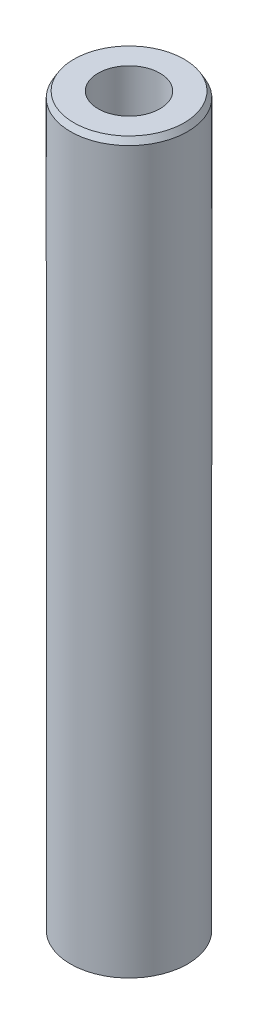
ISO-10303-21;
HEADER;
FILE_DESCRIPTION(('STEP AP214'),'2;1');
FILE_NAME('part.step','',(''),(''),'','','');
FILE_SCHEMA(('AUTOMOTIVE_DESIGN { 1 0 10303 214 1 1 1 1 }'));
ENDSEC;
DATA;
#1=APPLICATION_CONTEXT('core data for automotive mechanical design processes');
#2=APPLICATION_PROTOCOL_DEFINITION('international standard','automotive_design',2000,#1);
#3=PRODUCT_CONTEXT('',#1,'mechanical');
#4=PRODUCT('Part','Part','',(#3));
#5=PRODUCT_RELATED_PRODUCT_CATEGORY('part','',(#4));
#6=PRODUCT_DEFINITION_FORMATION('','',#4);
#7=PRODUCT_DEFINITION_CONTEXT('part definition',#1,'design');
#8=PRODUCT_DEFINITION('design','',#6,#7);
#9=PRODUCT_DEFINITION_SHAPE('','',#8);
#10=(LENGTH_UNIT() NAMED_UNIT(*) SI_UNIT(.MILLI.,.METRE.));
#11=(NAMED_UNIT(*) PLANE_ANGLE_UNIT() SI_UNIT($,.RADIAN.));
#12=(NAMED_UNIT(*) SI_UNIT($,.STERADIAN.) SOLID_ANGLE_UNIT());
#13=UNCERTAINTY_MEASURE_WITH_UNIT(LENGTH_MEASURE(1.E-05),#10,'distance_accuracy_value','');
#14=(GEOMETRIC_REPRESENTATION_CONTEXT(3) GLOBAL_UNCERTAINTY_ASSIGNED_CONTEXT((#13)) GLOBAL_UNIT_ASSIGNED_CONTEXT((#10,
#11,#12)) REPRESENTATION_CONTEXT('',''));
#15=CARTESIAN_POINT('',(0.,0.,0.));
#16=DIRECTION('',(0.,0.,1.));
#17=DIRECTION('',(1.,0.,0.));
#18=AXIS2_PLACEMENT_3D('',#15,#16,#17);
#19=CARTESIAN_POINT('',(0.,187.034323666018,0.));
#20=DIRECTION('',(0.,-1.,0.));
#21=DIRECTION('',(0.,0.,-1.));
#22=AXIS2_PLACEMENT_3D('',#19,#20,#21);
#23=CYLINDRICAL_SURFACE('',#22,15.);
#24=CARTESIAN_POINT('',(0.,185.514735619687,0.));
#25=DIRECTION('',(0.,1.,0.));
#26=DIRECTION('',(0.,0.,1.));
#27=AXIS2_PLACEMENT_3D('',#24,#25,#26);
#28=CIRCLE('',#27,15.);
#29=CARTESIAN_POINT('',(0.,185.514735619687,-15.));
#30=VERTEX_POINT('',#29);
#31=EDGE_CURVE('E50',#30,#30,#28,.F.);
#32=CARTESIAN_POINT('',(0.,0.877334567606525,0.));
#33=DIRECTION('',(0.,1.,0.));
#34=DIRECTION('',(0.,0.,1.));
#35=AXIS2_PLACEMENT_3D('',#32,#33,#34);
#36=CIRCLE('',#35,15.);
#37=CARTESIAN_POINT('',(0.,0.877334567606525,-15.));
#38=VERTEX_POINT('',#37);
#39=EDGE_CURVE('E51',#38,#38,#36,.T.);
#40=CARTESIAN_POINT('',(0.,185.514735619687,-15.));
#41=CARTESIAN_POINT('',(0.,183.591429358728,-15.));
#42=CARTESIAN_POINT('',(0.,181.668123097769,-15.));
#43=CARTESIAN_POINT('',(0.,177.82151057585,-15.));
#44=CARTESIAN_POINT('',(0.,175.898204314891,-15.));
#45=CARTESIAN_POINT('',(0.,172.051591792973,-15.));
#46=CARTESIAN_POINT('',(0.,170.128285532014,-15.));
#47=CARTESIAN_POINT('',(0.,166.281673010095,-15.));
#48=CARTESIAN_POINT('',(0.,164.358366749136,-15.));
#49=CARTESIAN_POINT('',(0.,160.511754227218,-15.));
#50=CARTESIAN_POINT('',(0.,158.588447966259,-15.));
#51=CARTESIAN_POINT('',(0.,154.74183544434,-15.));
#52=CARTESIAN_POINT('',(0.,152.818529183381,-15.));
#53=CARTESIAN_POINT('',(0.,148.971916661463,-15.));
#54=CARTESIAN_POINT('',(0.,147.048610400503,-15.));
#55=CARTESIAN_POINT('',(0.,143.201997878585,-15.));
#56=CARTESIAN_POINT('',(0.,141.278691617626,-15.));
#57=CARTESIAN_POINT('',(0.,137.432079095708,-15.));
#58=CARTESIAN_POINT('',(0.,135.508772834748,-15.));
#59=CARTESIAN_POINT('',(0.,131.66216031283,-15.));
#60=CARTESIAN_POINT('',(0.,129.738854051871,-15.));
#61=CARTESIAN_POINT('',(0.,125.892241529953,-15.));
#62=CARTESIAN_POINT('',(0.,123.968935268993,-15.));
#63=CARTESIAN_POINT('',(0.,120.122322747075,-15.));
#64=CARTESIAN_POINT('',(0.,118.199016486116,-15.));
#65=CARTESIAN_POINT('',(0.,114.352403964198,-15.));
#66=CARTESIAN_POINT('',(0.,112.429097703238,-15.));
#67=CARTESIAN_POINT('',(0.,108.58248518132,-15.));
#68=CARTESIAN_POINT('',(0.,106.659178920361,-15.));
#69=CARTESIAN_POINT('',(0.,102.812566398443,-15.));
#70=CARTESIAN_POINT('',(0.,100.889260137483,-15.));
#71=CARTESIAN_POINT('',(0.,97.0426476155651,-15.));
#72=CARTESIAN_POINT('',(0.,95.1193413546059,-15.));
#73=CARTESIAN_POINT('',(0.,91.2727288326875,-15.));
#74=CARTESIAN_POINT('',(0.,89.3494225717284,-15.));
#75=CARTESIAN_POINT('',(0.,85.50281004981,-15.));
#76=CARTESIAN_POINT('',(0.,83.5795037888509,-15.));
#77=CARTESIAN_POINT('',(0.,79.7328912669325,-15.));
#78=CARTESIAN_POINT('',(0.,77.8095850059733,-15.));
#79=CARTESIAN_POINT('',(0.,73.962972484055,-15.));
#80=CARTESIAN_POINT('',(0.,72.0396662230958,-15.));
#81=CARTESIAN_POINT('',(0.,68.1930537011775,-15.));
#82=CARTESIAN_POINT('',(0.,66.2697474402183,-15.));
#83=CARTESIAN_POINT('',(0.,62.4231349183,-15.));
#84=CARTESIAN_POINT('',(0.,60.4998286573408,-15.));
#85=CARTESIAN_POINT('',(0.,56.6532161354225,-15.));
#86=CARTESIAN_POINT('',(0.,54.7299098744633,-15.));
#87=CARTESIAN_POINT('',(0.,50.883297352545,-15.));
#88=CARTESIAN_POINT('',(0.,48.9599910915858,-15.));
#89=CARTESIAN_POINT('',(0.,45.1133785696674,-15.));
#90=CARTESIAN_POINT('',(0.,43.1900723087083,-15.));
#91=CARTESIAN_POINT('',(0.,39.3434597867899,-15.));
#92=CARTESIAN_POINT('',(0.,37.4201535258307,-15.));
#93=CARTESIAN_POINT('',(0.,33.5735410039124,-15.));
#94=CARTESIAN_POINT('',(0.,31.6502347429533,-15.));
#95=CARTESIAN_POINT('',(0.,27.8036222210349,-15.));
#96=CARTESIAN_POINT('',(0.,25.8803159600757,-15.));
#97=CARTESIAN_POINT('',(0.,22.0337034381574,-15.));
#98=CARTESIAN_POINT('',(0.,20.1103971771982,-15.));
#99=CARTESIAN_POINT('',(0.,16.2637846552799,-15.));
#100=CARTESIAN_POINT('',(0.,14.3404783943207,-15.));
#101=CARTESIAN_POINT('',(0.,10.4938658724024,-15.));
#102=CARTESIAN_POINT('',(0.,8.57055961144321,-15.));
#103=CARTESIAN_POINT('',(0.,4.72394708952488,-15.));
#104=CARTESIAN_POINT('',(0.,2.8006408285657,-15.));
#105=CARTESIAN_POINT('',(0.,0.877334567606525,-15.));
#106=B_SPLINE_CURVE_WITH_KNOTS('',3,(#40,#41,#42,#43,#44,#45,#46,#47,#48,#49,#50,#51,#52,#53,
#54,#55,#56,#57,#58,#59,#60,#61,#62,#63,#64,#65,#66,#67,#68,#69,#70,#71,#72,#73,#74,#75,#76,#77,
#78,#79,#80,#81,#82,#83,#84,#85,#86,#87,#88,#89,#90,#91,#92,#93,#94,#95,#96,#97,#98,#99,#100,
#101,#102,#103,#104,#105),.UNSPECIFIED.,.F.,.F.,(4,2,2,2,2,2,2,2,2,2,2,2,2,2,2,2,2,2,2,2,2,2,2,
2,2,2,2,2,2,2,2,2,4),(0.,5.76991878287753,11.5398375657551,17.3097563486326,23.0796751315101,
28.8495939143876,34.6195126972651,40.3894314801426,46.1593502630201,51.9292690458976,
57.6991878287751,63.4691066116526,69.2390253945302,75.0089441774077,80.7788629602852,
86.5487817431627,92.3187005260402,98.0886193089177,103.858538091795,109.628456874673,
115.39837565755,121.168294440428,126.938213223305,132.708132006183,138.47805078906,
144.247969571938,150.017888354815,155.787807137693,161.55772592057,167.327644703448,
173.097563486325,178.867482269203,184.63740105208),.UNSPECIFIED.);
#107=EDGE_CURVE('BSEAM39',#30,#38,#106,.T.);
#108=ORIENTED_EDGE('',*,*,#31,.T.);
#109=ORIENTED_EDGE('',*,*,#39,.T.);
#110=ORIENTED_EDGE('',*,*,#107,.T.);
#111=ORIENTED_EDGE('',*,*,#107,.F.);
#112=EDGE_LOOP('',(#108,#110,#109,#111));
#113=FACE_BOUND('',#112,.T.);
#114=ADVANCED_FACE('F39',(#113),#23,.T.);
#115=CARTESIAN_POINT('',(0.,187.034323666018,0.));
#116=DIRECTION('',(0.,1.,0.));
#117=DIRECTION('',(0.,0.,1.));
#118=AXIS2_PLACEMENT_3D('',#115,#116,#117);
#119=PLANE('',#118);
#120=CARTESIAN_POINT('',(0.,187.034323666018,0.));
#121=DIRECTION('',(0.,1.,0.));
#122=DIRECTION('',(0.,0.,1.));
#123=AXIS2_PLACEMENT_3D('',#120,#121,#122);
#124=CIRCLE('',#123,14.1226654323936);
#125=CARTESIAN_POINT('',(0.,187.034323666018,-14.1226654323936));
#126=VERTEX_POINT('',#125);
#127=EDGE_CURVE('E54',#126,#126,#124,.T.);
#128=ORIENTED_EDGE('',*,*,#127,.T.);
#129=EDGE_LOOP('',(#128));
#130=FACE_BOUND('',#129,.T.);
#131=CARTESIAN_POINT('',(0.,187.034323666018,0.));
#132=DIRECTION('',(0.,1.,0.));
#133=DIRECTION('',(0.,0.,1.));
#134=AXIS2_PLACEMENT_3D('',#131,#132,#133);
#135=CIRCLE('',#134,7.91619731904316);
#136=CARTESIAN_POINT('',(0.,187.034323666018,-7.91619731904316));
#137=VERTEX_POINT('',#136);
#138=EDGE_CURVE('E58',#137,#137,#135,.T.);
#139=ORIENTED_EDGE('',*,*,#138,.F.);
#140=EDGE_LOOP('',(#139));
#141=FACE_BOUND('',#140,.T.);
#142=ADVANCED_FACE('F69',(#130,#141),#119,.T.);
#143=CARTESIAN_POINT('',(0.,0.,0.));
#144=DIRECTION('',(0.,1.,0.));
#145=DIRECTION('',(0.,0.,1.));
#146=AXIS2_PLACEMENT_3D('',#143,#144,#145);
#147=PLANE('',#146);
#148=CARTESIAN_POINT('',(0.,0.,0.));
#149=DIRECTION('',(0.,1.,0.));
#150=DIRECTION('',(0.,0.,1.));
#151=AXIS2_PLACEMENT_3D('',#148,#149,#150);
#152=CIRCLE('',#151,13.480411953669);
#153=CARTESIAN_POINT('',(0.,0.,13.480411953669));
#154=VERTEX_POINT('',#153);
#155=EDGE_CURVE('E10',#154,#154,#152,.F.);
#156=ORIENTED_EDGE('',*,*,#155,.T.);
#157=EDGE_LOOP('',(#156));
#158=FACE_BOUND('',#157,.T.);
#159=CARTESIAN_POINT('',(0.,0.,0.));
#160=DIRECTION('',(0.,1.,0.));
#161=DIRECTION('',(0.,0.,1.));
#162=AXIS2_PLACEMENT_3D('',#159,#160,#161);
#163=CIRCLE('',#162,7.91619731904316);
#164=CARTESIAN_POINT('',(0.,0.,-7.91619731904316));
#165=VERTEX_POINT('',#164);
#166=EDGE_CURVE('E63',#165,#165,#163,.T.);
#167=ORIENTED_EDGE('',*,*,#166,.T.);
#168=EDGE_LOOP('',(#167));
#169=FACE_BOUND('',#168,.T.);
#170=ADVANCED_FACE('F75',(#158,#169),#147,.F.);
#171=CARTESIAN_POINT('',(0.,187.034323666018,0.));
#172=DIRECTION('',(0.,-1.,0.));
#173=DIRECTION('',(0.,0.,-1.));
#174=AXIS2_PLACEMENT_3D('',#171,#172,#173);
#175=CYLINDRICAL_SURFACE('',#174,7.91619731904316);
#176=CARTESIAN_POINT('',(0.,187.034323666018,-7.91619731904316));
#177=CARTESIAN_POINT('',(0.,185.086049461163,-7.91619731904316));
#178=CARTESIAN_POINT('',(0.,183.137775256309,-7.91619731904316));
#179=CARTESIAN_POINT('',(0.,179.2412268466,-7.91619731904316));
#180=CARTESIAN_POINT('',(0.,177.292952641746,-7.91619731904316));
#181=CARTESIAN_POINT('',(0.,173.396404232037,-7.91619731904316));
#182=CARTESIAN_POINT('',(0.,171.448130027183,-7.91619731904316));
#183=CARTESIAN_POINT('',(0.,167.551581617474,-7.91619731904316));
#184=CARTESIAN_POINT('',(0.,165.60330741262,-7.91619731904316));
#185=CARTESIAN_POINT('',(0.,161.706759002911,-7.91619731904316));
#186=CARTESIAN_POINT('',(0.,159.758484798057,-7.91619731904316));
#187=CARTESIAN_POINT('',(0.,155.861936388348,-7.91619731904316));
#188=CARTESIAN_POINT('',(0.,153.913662183494,-7.91619731904316));
#189=CARTESIAN_POINT('',(0.,150.017113773785,-7.91619731904316));
#190=CARTESIAN_POINT('',(0.,148.068839568931,-7.91619731904316));
#191=CARTESIAN_POINT('',(0.,144.172291159222,-7.91619731904316));
#192=CARTESIAN_POINT('',(0.,142.224016954368,-7.91619731904316));
#193=CARTESIAN_POINT('',(0.,138.327468544659,-7.91619731904316));
#194=CARTESIAN_POINT('',(0.,136.379194339805,-7.91619731904316));
#195=CARTESIAN_POINT('',(0.,132.482645930096,-7.91619731904316));
#196=CARTESIAN_POINT('',(0.,130.534371725241,-7.91619731904316));
#197=CARTESIAN_POINT('',(0.,126.637823315533,-7.91619731904316));
#198=CARTESIAN_POINT('',(0.,124.689549110678,-7.91619731904316));
#199=CARTESIAN_POINT('',(0.,120.79300070097,-7.91619731904316));
#200=CARTESIAN_POINT('',(0.,118.844726496115,-7.91619731904316));
#201=CARTESIAN_POINT('',(0.,114.948178086407,-7.91619731904316));
#202=CARTESIAN_POINT('',(0.,112.999903881552,-7.91619731904316));
#203=CARTESIAN_POINT('',(0.,109.103355471844,-7.91619731904316));
#204=CARTESIAN_POINT('',(0.,107.155081266989,-7.91619731904316));
#205=CARTESIAN_POINT('',(0.,103.258532857281,-7.91619731904316));
#206=CARTESIAN_POINT('',(0.,101.310258652426,-7.91619731904316));
#207=CARTESIAN_POINT('',(0.,97.4137102427175,-7.91619731904316));
#208=CARTESIAN_POINT('',(0.,95.4654360378632,-7.91619731904316));
#209=CARTESIAN_POINT('',(0.,91.5688876281545,-7.91619731904316));
#210=CARTESIAN_POINT('',(0.,89.6206134233001,-7.91619731904316));
#211=CARTESIAN_POINT('',(0.,85.7240650135914,-7.91619731904316));
#212=CARTESIAN_POINT('',(0.,83.7757908087371,-7.91619731904316));
#213=CARTESIAN_POINT('',(0.,79.8792423990284,-7.91619731904316));
#214=CARTESIAN_POINT('',(0.,77.930968194174,-7.91619731904316));
#215=CARTESIAN_POINT('',(0.,74.0344197844653,-7.91619731904316));
#216=CARTESIAN_POINT('',(0.,72.086145579611,-7.91619731904316));
#217=CARTESIAN_POINT('',(0.,68.1895971699023,-7.91619731904316));
#218=CARTESIAN_POINT('',(0.,66.2413229650479,-7.91619731904316));
#219=CARTESIAN_POINT('',(0.,62.3447745553392,-7.91619731904316));
#220=CARTESIAN_POINT('',(0.,60.3965003504849,-7.91619731904316));
#221=CARTESIAN_POINT('',(0.,56.4999519407762,-7.91619731904316));
#222=CARTESIAN_POINT('',(0.,54.5516777359218,-7.91619731904316));
#223=CARTESIAN_POINT('',(0.,50.6551293262131,-7.91619731904316));
#224=CARTESIAN_POINT('',(0.,48.7068551213588,-7.91619731904316));
#225=CARTESIAN_POINT('',(0.,44.8103067116501,-7.91619731904316));
#226=CARTESIAN_POINT('',(0.,42.8620325067957,-7.91619731904316));
#227=CARTESIAN_POINT('',(0.,38.965484097087,-7.91619731904316));
#228=CARTESIAN_POINT('',(0.,37.0172098922327,-7.91619731904316));
#229=CARTESIAN_POINT('',(0.,33.120661482524,-7.91619731904316));
#230=CARTESIAN_POINT('',(0.,31.1723872776696,-7.91619731904316));
#231=CARTESIAN_POINT('',(0.,27.2758388679609,-7.91619731904316));
#232=CARTESIAN_POINT('',(0.,25.3275646631066,-7.91619731904316));
#233=CARTESIAN_POINT('',(0.,21.4310162533979,-7.91619731904316));
#234=CARTESIAN_POINT('',(0.,19.4827420485435,-7.91619731904316));
#235=CARTESIAN_POINT('',(0.,15.5861936388348,-7.91619731904316));
#236=CARTESIAN_POINT('',(0.,13.6379194339805,-7.91619731904316));
#237=CARTESIAN_POINT('',(0.,9.74137102427175,-7.91619731904316));
#238=CARTESIAN_POINT('',(0.,7.79309681941739,-7.91619731904316));
#239=CARTESIAN_POINT('',(0.,3.89654840970869,-7.91619731904316));
#240=CARTESIAN_POINT('',(0.,1.94827420485435,-7.91619731904316));
#241=CARTESIAN_POINT('',(0.,0.,-7.91619731904316));
#242=B_SPLINE_CURVE_WITH_KNOTS('',3,(#176,#177,#178,#179,#180,#181,#182,#183,#184,#185,#186,
#187,#188,#189,#190,#191,#192,#193,#194,#195,#196,#197,#198,#199,#200,#201,#202,#203,#204,#205,
#206,#207,#208,#209,#210,#211,#212,#213,#214,#215,#216,#217,#218,#219,#220,#221,#222,#223,#224,
#225,#226,#227,#228,#229,#230,#231,#232,#233,#234,#235,#236,#237,#238,#239,#240,#241),
.UNSPECIFIED.,.F.,.F.,(4,2,2,2,2,2,2,2,2,2,2,2,2,2,2,2,2,2,2,2,2,2,2,2,2,2,2,2,2,2,2,2,4),(0.,
5.84482261456304,11.6896452291261,17.5344678436891,23.3792904582522,29.2241130728152,
35.0689356873783,40.9137583019413,46.7585809165044,52.6034035310675,58.4482261456305,
64.2930487601935,70.1378713747566,75.9826939893196,81.8275166038827,87.6723392184458,
93.5171618330088,99.3619844475719,105.206807062135,111.051629676698,116.896452291261,
122.741274905824,128.586097520387,134.43092013495,140.275742749513,146.120565364076,
151.965387978639,157.810210593202,163.655033207765,169.499855822328,175.344678436892,
181.189501051455,187.034323666018),.UNSPECIFIED.);
#243=EDGE_CURVE('BSEAM70',#137,#165,#242,.T.);
#244=ORIENTED_EDGE('',*,*,#138,.T.);
#245=ORIENTED_EDGE('',*,*,#166,.F.);
#246=ORIENTED_EDGE('',*,*,#243,.T.);
#247=ORIENTED_EDGE('',*,*,#243,.F.);
#248=EDGE_LOOP('',(#244,#246,#245,#247));
#249=FACE_BOUND('',#248,.T.);
#250=ADVANCED_FACE('F70',(#249),#175,.F.);
#251=CARTESIAN_POINT('',(0.,187.034323666018,0.));
#252=DIRECTION('',(0.,-1.,0.));
#253=DIRECTION('',(0.,0.,-1.));
#254=AXIS2_PLACEMENT_3D('',#251,#252,#253);
#255=CONICAL_SURFACE('',#254,14.1226654323936,0.523598775598293);
#256=CARTESIAN_POINT('',(0.,185.514735619687,-15.));
#257=CARTESIAN_POINT('',(0.,185.530564661836,-14.9908610982541));
#258=CARTESIAN_POINT('',(0.,185.546393703985,-14.9817221965082));
#259=CARTESIAN_POINT('',(0.,185.578051788284,-14.9634443930164));
#260=CARTESIAN_POINT('',(0.,185.593880830433,-14.9543054912705));
#261=CARTESIAN_POINT('',(0.,185.625538914732,-14.9360276877787));
#262=CARTESIAN_POINT('',(0.,185.641367956881,-14.9268887860328));
#263=CARTESIAN_POINT('',(0.,185.67302604118,-14.908610982541));
#264=CARTESIAN_POINT('',(0.,185.688855083329,-14.8994720807951));
#265=CARTESIAN_POINT('',(0.,185.720513167628,-14.8811942773033));
#266=CARTESIAN_POINT('',(0.,185.736342209777,-14.8720553755574));
#267=CARTESIAN_POINT('',(0.,185.768000294075,-14.8537775720656));
#268=CARTESIAN_POINT('',(0.,185.783829336225,-14.8446386703197));
#269=CARTESIAN_POINT('',(0.,185.815487420523,-14.8263608668279));
#270=CARTESIAN_POINT('',(0.,185.831316462672,-14.817221965082));
#271=CARTESIAN_POINT('',(0.,185.862974546971,-14.7989441615902));
#272=CARTESIAN_POINT('',(0.,185.87880358912,-14.7898052598443));
#273=CARTESIAN_POINT('',(0.,185.910461673419,-14.7715274563525));
#274=CARTESIAN_POINT('',(0.,185.926290715568,-14.7623885546066));
#275=CARTESIAN_POINT('',(0.,185.957948799867,-14.7441107511148));
#276=CARTESIAN_POINT('',(0.,185.973777842016,-14.7349718493689));
#277=CARTESIAN_POINT('',(0.,186.005435926315,-14.7166940458771));
#278=CARTESIAN_POINT('',(0.,186.021264968464,-14.7075551441312));
#279=CARTESIAN_POINT('',(0.,186.052923052762,-14.6892773406394));
#280=CARTESIAN_POINT('',(0.,186.068752094912,-14.6801384388935));
#281=CARTESIAN_POINT('',(0.,186.10041017921,-14.6618606354017));
#282=CARTESIAN_POINT('',(0.,186.11623922136,-14.6527217336558));
#283=CARTESIAN_POINT('',(0.,186.147897305658,-14.634443930164));
#284=CARTESIAN_POINT('',(0.,186.163726347807,-14.6253050284181));
#285=CARTESIAN_POINT('',(0.,186.195384432106,-14.6070272249263));
#286=CARTESIAN_POINT('',(0.,186.211213474255,-14.5978883231804));
#287=CARTESIAN_POINT('',(0.,186.242871558554,-14.5796105196886));
#288=CARTESIAN_POINT('',(0.,186.258700600703,-14.5704716179427));
#289=CARTESIAN_POINT('',(0.,186.290358685002,-14.5521938144509));
#290=CARTESIAN_POINT('',(0.,186.306187727151,-14.543054912705));
#291=CARTESIAN_POINT('',(0.,186.337845811449,-14.5247771092132));
#292=CARTESIAN_POINT('',(0.,186.353674853599,-14.5156382074673));
#293=CARTESIAN_POINT('',(0.,186.385332937897,-14.4973604039755));
#294=CARTESIAN_POINT('',(0.,186.401161980047,-14.4882215022296));
#295=CARTESIAN_POINT('',(0.,186.432820064345,-14.4699436987378));
#296=CARTESIAN_POINT('',(0.,186.448649106494,-14.4608047969919));
#297=CARTESIAN_POINT('',(0.,186.480307190793,-14.4425269935001));
#298=CARTESIAN_POINT('',(0.,186.496136232942,-14.4333880917542));
#299=CARTESIAN_POINT('',(0.,186.527794317241,-14.4151102882624));
#300=CARTESIAN_POINT('',(0.,186.54362335939,-14.4059713865165));
#301=CARTESIAN_POINT('',(0.,186.575281443689,-14.3876935830247));
#302=CARTESIAN_POINT('',(0.,186.591110485838,-14.3785546812788));
#303=CARTESIAN_POINT('',(0.,186.622768570136,-14.360276877787));
#304=CARTESIAN_POINT('',(0.,186.638597612286,-14.3511379760411));
#305=CARTESIAN_POINT('',(0.,186.670255696584,-14.3328601725493));
#306=CARTESIAN_POINT('',(0.,186.686084738734,-14.3237212708034));
#307=CARTESIAN_POINT('',(0.,186.717742823032,-14.3054434673116));
#308=CARTESIAN_POINT('',(0.,186.733571865181,-14.2963045655657));
#309=CARTESIAN_POINT('',(0.,186.76522994948,-14.2780267620739));
#310=CARTESIAN_POINT('',(0.,186.781058991629,-14.268887860328));
#311=CARTESIAN_POINT('',(0.,186.812717075928,-14.2506100568362));
#312=CARTESIAN_POINT('',(0.,186.828546118077,-14.2414711550903));
#313=CARTESIAN_POINT('',(0.,186.860204202376,-14.2231933515985));
#314=CARTESIAN_POINT('',(0.,186.876033244525,-14.2140544498526));
#315=CARTESIAN_POINT('',(0.,186.907691328823,-14.1957766463608));
#316=CARTESIAN_POINT('',(0.,186.923520370973,-14.1866377446149));
#317=CARTESIAN_POINT('',(0.,186.955178455271,-14.1683599411231));
#318=CARTESIAN_POINT('',(0.,186.971007497421,-14.1592210393772));
#319=CARTESIAN_POINT('',(0.,187.002665581719,-14.1409432358854));
#320=CARTESIAN_POINT('',(0.,187.018494623868,-14.1318043341395));
#321=CARTESIAN_POINT('',(0.,187.034323666018,-14.1226654323936));
#322=B_SPLINE_CURVE_WITH_KNOTS('',3,(#256,#257,#258,#259,#260,#261,#262,#263,#264,#265,#266,
#267,#268,#269,#270,#271,#272,#273,#274,#275,#276,#277,#278,#279,#280,#281,#282,#283,#284,#285,
#286,#287,#288,#289,#290,#291,#292,#293,#294,#295,#296,#297,#298,#299,#300,#301,#302,#303,#304,
#305,#306,#307,#308,#309,#310,#311,#312,#313,#314,#315,#316,#317,#318,#319,#320,#321),
.UNSPECIFIED.,.F.,.F.,(4,2,2,2,2,2,2,2,2,2,2,2,2,2,2,2,2,2,2,2,2,2,2,2,2,2,2,2,2,2,2,2,4),(0.,
0.054833410475377,0.109666820950777,0.164500231426177,0.219333641901578,0.274167052376979,
0.329000462852379,0.383833873327779,0.43866728380318,0.49350069427858,0.548334104753981,
0.603167515229382,0.658000925704782,0.712834336180182,0.767667746655582,0.822501157130983,
0.877334567606384,0.93216797808176,0.98700138855716,1.04183479903256,1.09666820950796,
1.15150161998336,1.20633503045876,1.26116844093416,1.31600185140956,1.37083526188496,
1.42566867236036,1.48050208283576,1.53533549331116,1.59016890378657,1.64500231426197,
1.69983572473737,1.75466913521277),.UNSPECIFIED.);
#323=EDGE_CURVE('BSEAM81',#30,#126,#322,.T.);
#324=ORIENTED_EDGE('',*,*,#31,.F.);
#325=ORIENTED_EDGE('',*,*,#127,.F.);
#326=ORIENTED_EDGE('',*,*,#323,.T.);
#327=ORIENTED_EDGE('',*,*,#323,.F.);
#328=EDGE_LOOP('',(#324,#326,#325,#327));
#329=FACE_BOUND('',#328,.T.);
#330=ADVANCED_FACE('F81',(#329),#255,.T.);
#331=CARTESIAN_POINT('',(0.,0.877334567606525,0.));
#332=DIRECTION('',(0.,1.,0.));
#333=DIRECTION('',(0.,0.,1.));
#334=AXIS2_PLACEMENT_3D('',#331,#332,#333);
#335=CONICAL_SURFACE('',#334,15.,1.04719755119661);
#336=ORIENTED_EDGE('',*,*,#155,.F.);
#337=EDGE_LOOP('',(#336));
#338=FACE_BOUND('',#337,.T.);
#339=ORIENTED_EDGE('',*,*,#39,.F.);
#340=EDGE_LOOP('',(#339));
#341=FACE_BOUND('',#340,.T.);
#342=ADVANCED_FACE('F45',(#338,#341),#335,.T.);
#343=CLOSED_SHELL('',(#114,#142,#170,#250,#330,#342));
#344=MANIFOLD_SOLID_BREP('B2',#343);
#345=ADVANCED_BREP_SHAPE_REPRESENTATION('',(#18,#344),#14);
#346=SHAPE_DEFINITION_REPRESENTATION(#9,#345);
ENDSEC;
END-ISO-10303-21;
